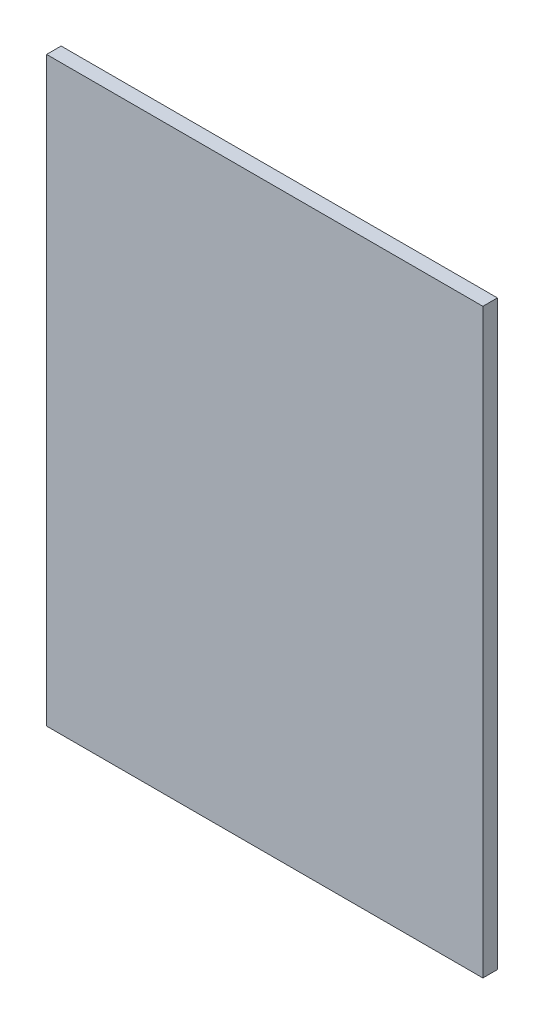
ISO-10303-21;
HEADER;
FILE_DESCRIPTION(('STEP AP214'),'2;1');
FILE_NAME('part.step','',(''),(''),'','','');
FILE_SCHEMA(('AUTOMOTIVE_DESIGN { 1 0 10303 214 1 1 1 1 }'));
ENDSEC;
DATA;
#1=APPLICATION_CONTEXT('core data for automotive mechanical design processes');
#2=APPLICATION_PROTOCOL_DEFINITION('international standard','automotive_design',2000,#1);
#3=PRODUCT_CONTEXT('',#1,'mechanical');
#4=PRODUCT('Part','Part','',(#3));
#5=PRODUCT_RELATED_PRODUCT_CATEGORY('part','',(#4));
#6=PRODUCT_DEFINITION_FORMATION('','',#4);
#7=PRODUCT_DEFINITION_CONTEXT('part definition',#1,'design');
#8=PRODUCT_DEFINITION('design','',#6,#7);
#9=PRODUCT_DEFINITION_SHAPE('','',#8);
#10=(LENGTH_UNIT() NAMED_UNIT(*) SI_UNIT(.MILLI.,.METRE.));
#11=(NAMED_UNIT(*) PLANE_ANGLE_UNIT() SI_UNIT($,.RADIAN.));
#12=(NAMED_UNIT(*) SI_UNIT($,.STERADIAN.) SOLID_ANGLE_UNIT());
#13=UNCERTAINTY_MEASURE_WITH_UNIT(LENGTH_MEASURE(1.E-05),#10,'distance_accuracy_value','');
#14=(GEOMETRIC_REPRESENTATION_CONTEXT(3) GLOBAL_UNCERTAINTY_ASSIGNED_CONTEXT((#13)) GLOBAL_UNIT_ASSIGNED_CONTEXT((#10,
#11,#12)) REPRESENTATION_CONTEXT('',''));
#15=CARTESIAN_POINT('',(0.,0.,0.));
#16=DIRECTION('',(0.,0.,1.));
#17=DIRECTION('',(1.,0.,0.));
#18=AXIS2_PLACEMENT_3D('',#15,#16,#17);
#19=CARTESIAN_POINT('',(0.,0.,10.));
#20=DIRECTION('',(1.,0.,0.));
#21=DIRECTION('',(0.,0.,-1.));
#22=AXIS2_PLACEMENT_3D('',#19,#20,#21);
#23=PLANE('',#22);
#24=DIRECTION('',(0.,-1.,0.));
#25=VECTOR('',#24,1.);
#26=CARTESIAN_POINT('',(0.,0.,0.));
#27=LINE('',#26,#25);
#28=CARTESIAN_POINT('',(0.,400.,0.));
#29=VERTEX_POINT('',#28);
#30=CARTESIAN_POINT('',(0.,0.,0.));
#31=VERTEX_POINT('',#30);
#32=EDGE_CURVE('E94',#29,#31,#27,.T.);
#33=ORIENTED_EDGE('',*,*,#32,.T.);
#34=DIRECTION('',(0.,0.,-1.));
#35=VECTOR('',#34,1.);
#36=CARTESIAN_POINT('',(0.,0.,10.));
#37=LINE('',#36,#35);
#38=CARTESIAN_POINT('',(0.,0.,10.));
#39=VERTEX_POINT('',#38);
#40=EDGE_CURVE('E11',#39,#31,#37,.T.);
#41=ORIENTED_EDGE('',*,*,#40,.F.);
#42=DIRECTION('',(0.,-1.,0.));
#43=VECTOR('',#42,1.);
#44=CARTESIAN_POINT('',(0.,0.,10.));
#45=LINE('',#44,#43);
#46=CARTESIAN_POINT('',(0.,400.,10.));
#47=VERTEX_POINT('',#46);
#48=EDGE_CURVE('E82',#47,#39,#45,.T.);
#49=ORIENTED_EDGE('',*,*,#48,.F.);
#50=DIRECTION('',(0.,0.,-1.));
#51=VECTOR('',#50,1.);
#52=CARTESIAN_POINT('',(0.,400.,10.));
#53=LINE('',#52,#51);
#54=EDGE_CURVE('E90',#47,#29,#53,.T.);
#55=ORIENTED_EDGE('',*,*,#54,.T.);
#56=EDGE_LOOP('',(#33,#41,#49,#55));
#57=FACE_BOUND('',#56,.T.);
#58=ADVANCED_FACE('F31',(#57),#23,.F.);
#59=CARTESIAN_POINT('',(0.,0.,10.));
#60=DIRECTION('',(0.,1.,0.));
#61=DIRECTION('',(0.,0.,1.));
#62=AXIS2_PLACEMENT_3D('',#59,#60,#61);
#63=PLANE('',#62);
#64=DIRECTION('',(1.,0.,0.));
#65=VECTOR('',#64,1.);
#66=CARTESIAN_POINT('',(0.,0.,0.));
#67=LINE('',#66,#65);
#68=CARTESIAN_POINT('',(300.,0.,0.));
#69=VERTEX_POINT('',#68);
#70=EDGE_CURVE('E86',#31,#69,#67,.T.);
#71=ORIENTED_EDGE('',*,*,#70,.T.);
#72=DIRECTION('',(0.,0.,-1.));
#73=VECTOR('',#72,1.);
#74=CARTESIAN_POINT('',(300.,0.,10.));
#75=LINE('',#74,#73);
#76=CARTESIAN_POINT('',(300.,0.,10.));
#77=VERTEX_POINT('',#76);
#78=EDGE_CURVE('E39',#77,#69,#75,.T.);
#79=ORIENTED_EDGE('',*,*,#78,.F.);
#80=DIRECTION('',(1.,0.,0.));
#81=VECTOR('',#80,1.);
#82=CARTESIAN_POINT('',(0.,0.,10.));
#83=LINE('',#82,#81);
#84=EDGE_CURVE('E77',#39,#77,#83,.T.);
#85=ORIENTED_EDGE('',*,*,#84,.F.);
#86=ORIENTED_EDGE('',*,*,#40,.T.);
#87=EDGE_LOOP('',(#71,#79,#85,#86));
#88=FACE_BOUND('',#87,.T.);
#89=ADVANCED_FACE('F85',(#88),#63,.F.);
#90=CARTESIAN_POINT('',(300.,0.,10.));
#91=DIRECTION('',(-1.,0.,0.));
#92=DIRECTION('',(0.,0.,1.));
#93=AXIS2_PLACEMENT_3D('',#90,#91,#92);
#94=PLANE('',#93);
#95=DIRECTION('',(0.,1.,0.));
#96=VECTOR('',#95,1.);
#97=CARTESIAN_POINT('',(300.,0.,0.));
#98=LINE('',#97,#96);
#99=CARTESIAN_POINT('',(300.,400.,0.));
#100=VERTEX_POINT('',#99);
#101=EDGE_CURVE('E64',#69,#100,#98,.T.);
#102=ORIENTED_EDGE('',*,*,#101,.T.);
#103=DIRECTION('',(0.,0.,-1.));
#104=VECTOR('',#103,1.);
#105=CARTESIAN_POINT('',(300.,400.,10.));
#106=LINE('',#105,#104);
#107=CARTESIAN_POINT('',(300.,400.,10.));
#108=VERTEX_POINT('',#107);
#109=EDGE_CURVE('E87',#108,#100,#106,.T.);
#110=ORIENTED_EDGE('',*,*,#109,.F.);
#111=DIRECTION('',(0.,1.,0.));
#112=VECTOR('',#111,1.);
#113=CARTESIAN_POINT('',(300.,0.,10.));
#114=LINE('',#113,#112);
#115=EDGE_CURVE('E80',#77,#108,#114,.T.);
#116=ORIENTED_EDGE('',*,*,#115,.F.);
#117=ORIENTED_EDGE('',*,*,#78,.T.);
#118=EDGE_LOOP('',(#102,#110,#116,#117));
#119=FACE_BOUND('',#118,.T.);
#120=ADVANCED_FACE('F88',(#119),#94,.F.);
#121=CARTESIAN_POINT('',(0.,400.,10.));
#122=DIRECTION('',(0.,-1.,0.));
#123=DIRECTION('',(0.,0.,-1.));
#124=AXIS2_PLACEMENT_3D('',#121,#122,#123);
#125=PLANE('',#124);
#126=DIRECTION('',(-1.,0.,0.));
#127=VECTOR('',#126,1.);
#128=CARTESIAN_POINT('',(0.,400.,0.));
#129=LINE('',#128,#127);
#130=EDGE_CURVE('E70',#100,#29,#129,.T.);
#131=ORIENTED_EDGE('',*,*,#130,.T.);
#132=ORIENTED_EDGE('',*,*,#54,.F.);
#133=DIRECTION('',(-1.,0.,0.));
#134=VECTOR('',#133,1.);
#135=CARTESIAN_POINT('',(0.,400.,10.));
#136=LINE('',#135,#134);
#137=EDGE_CURVE('E47',#108,#47,#136,.T.);
#138=ORIENTED_EDGE('',*,*,#137,.F.);
#139=ORIENTED_EDGE('',*,*,#109,.T.);
#140=EDGE_LOOP('',(#131,#132,#138,#139));
#141=FACE_BOUND('',#140,.T.);
#142=ADVANCED_FACE('F101',(#141),#125,.F.);
#143=CARTESIAN_POINT('',(0.,400.,10.));
#144=DIRECTION('',(0.,0.,-1.));
#145=DIRECTION('',(-1.,0.,0.));
#146=AXIS2_PLACEMENT_3D('',#143,#144,#145);
#147=PLANE('',#146);
#148=ORIENTED_EDGE('',*,*,#48,.T.);
#149=ORIENTED_EDGE('',*,*,#84,.T.);
#150=ORIENTED_EDGE('',*,*,#115,.T.);
#151=ORIENTED_EDGE('',*,*,#137,.T.);
#152=EDGE_LOOP('',(#148,#149,#150,#151));
#153=FACE_BOUND('',#152,.T.);
#154=ADVANCED_FACE('F78',(#153),#147,.F.);
#155=CARTESIAN_POINT('',(0.,400.,0.));
#156=DIRECTION('',(0.,0.,-1.));
#157=DIRECTION('',(-1.,0.,0.));
#158=AXIS2_PLACEMENT_3D('',#155,#156,#157);
#159=PLANE('',#158);
#160=ORIENTED_EDGE('',*,*,#32,.F.);
#161=ORIENTED_EDGE('',*,*,#130,.F.);
#162=ORIENTED_EDGE('',*,*,#101,.F.);
#163=ORIENTED_EDGE('',*,*,#70,.F.);
#164=EDGE_LOOP('',(#160,#161,#162,#163));
#165=FACE_BOUND('',#164,.T.);
#166=ADVANCED_FACE('F104',(#165),#159,.T.);
#167=CLOSED_SHELL('',(#58,#89,#120,#142,#154,#166));
#168=MANIFOLD_SOLID_BREP('B2',#167);
#169=ADVANCED_BREP_SHAPE_REPRESENTATION('',(#18,#168),#14);
#170=SHAPE_DEFINITION_REPRESENTATION(#9,#169);
ENDSEC;
END-ISO-10303-21;
